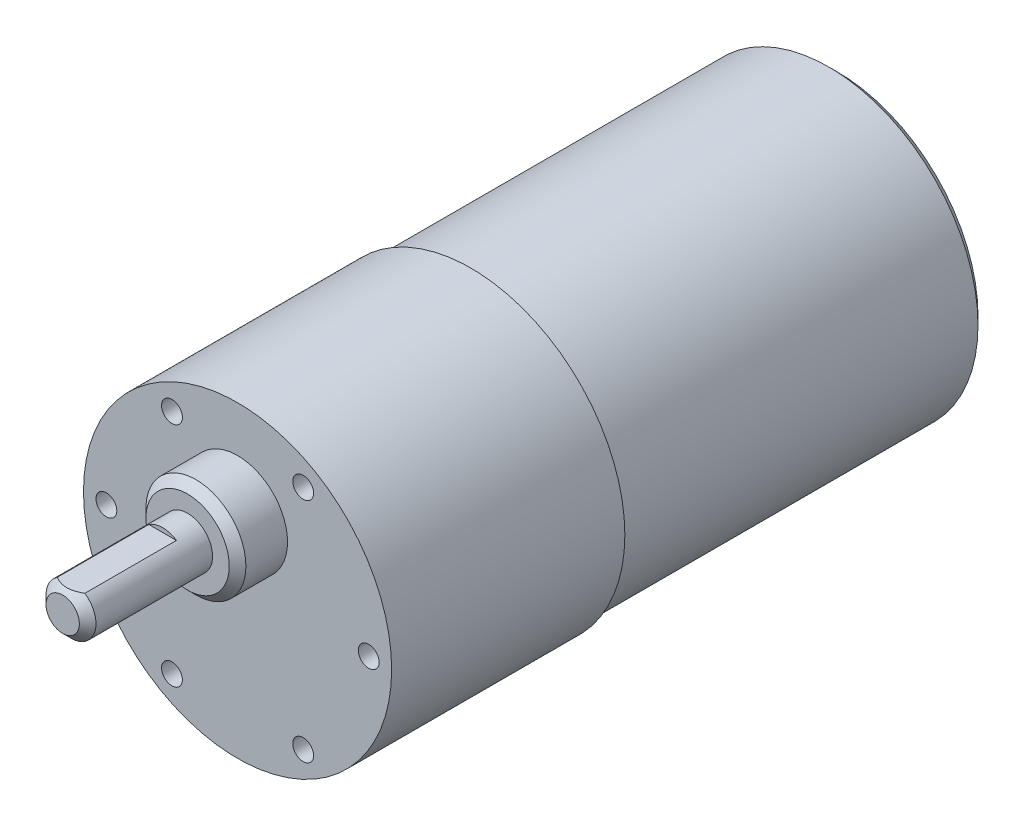
ISO-10303-21;
HEADER;
FILE_DESCRIPTION(('STEP AP214'),'2;1');
FILE_NAME('part.step','',(''),(''),'','','');
FILE_SCHEMA(('AUTOMOTIVE_DESIGN { 1 0 10303 214 1 1 1 1 }'));
ENDSEC;
DATA;
#1=APPLICATION_CONTEXT('core data for automotive mechanical design processes');
#2=APPLICATION_PROTOCOL_DEFINITION('international standard','automotive_design',2000,#1);
#3=PRODUCT_CONTEXT('',#1,'mechanical');
#4=PRODUCT('Part','Part','',(#3));
#5=PRODUCT_RELATED_PRODUCT_CATEGORY('part','',(#4));
#6=PRODUCT_DEFINITION_FORMATION('','',#4);
#7=PRODUCT_DEFINITION_CONTEXT('part definition',#1,'design');
#8=PRODUCT_DEFINITION('design','',#6,#7);
#9=PRODUCT_DEFINITION_SHAPE('','',#8);
#10=(LENGTH_UNIT() NAMED_UNIT(*) SI_UNIT(.MILLI.,.METRE.));
#11=(NAMED_UNIT(*) PLANE_ANGLE_UNIT() SI_UNIT($,.RADIAN.));
#12=(NAMED_UNIT(*) SI_UNIT($,.STERADIAN.) SOLID_ANGLE_UNIT());
#13=UNCERTAINTY_MEASURE_WITH_UNIT(LENGTH_MEASURE(1.E-05),#10,'distance_accuracy_value','');
#14=(GEOMETRIC_REPRESENTATION_CONTEXT(3) GLOBAL_UNCERTAINTY_ASSIGNED_CONTEXT((#13)) GLOBAL_UNIT_ASSIGNED_CONTEXT((#10,
#11,#12)) REPRESENTATION_CONTEXT('',''));
#15=CARTESIAN_POINT('',(0.,0.,0.));
#16=DIRECTION('',(0.,0.,1.));
#17=DIRECTION('',(1.,0.,0.));
#18=AXIS2_PLACEMENT_3D('',#15,#16,#17);
#19=CARTESIAN_POINT('',(0.,0.,44.));
#20=DIRECTION('',(0.,0.,-1.));
#21=DIRECTION('',(-1.,0.,0.));
#22=AXIS2_PLACEMENT_3D('',#19,#20,#21);
#23=CYLINDRICAL_SURFACE('',#22,17.9);
#24=CARTESIAN_POINT('',(0.,0.,1.));
#25=DIRECTION('',(0.,0.,1.));
#26=DIRECTION('',(1.,0.,0.));
#27=AXIS2_PLACEMENT_3D('',#24,#25,#26);
#28=CIRCLE('',#27,17.9);
#29=CARTESIAN_POINT('',(17.9,0.,1.));
#30=VERTEX_POINT('',#29);
#31=EDGE_CURVE('E53',#30,#30,#28,.T.);
#32=ORIENTED_EDGE('',*,*,#31,.T.);
#33=EDGE_LOOP('',(#32));
#34=FACE_BOUND('',#33,.T.);
#35=CARTESIAN_POINT('',(0.,0.,44.));
#36=DIRECTION('',(0.,0.,1.));
#37=DIRECTION('',(1.,0.,0.));
#38=AXIS2_PLACEMENT_3D('',#35,#36,#37);
#39=CIRCLE('',#38,17.9);
#40=CARTESIAN_POINT('',(17.9,0.,44.));
#41=VERTEX_POINT('',#40);
#42=EDGE_CURVE('E167',#41,#41,#39,.T.);
#43=ORIENTED_EDGE('',*,*,#42,.F.);
#44=EDGE_LOOP('',(#43));
#45=FACE_BOUND('',#44,.T.);
#46=ADVANCED_FACE('F44',(#34,#45),#23,.T.);
#47=CARTESIAN_POINT('',(0.,0.,0.));
#48=DIRECTION('',(0.,0.,1.));
#49=DIRECTION('',(1.,0.,0.));
#50=AXIS2_PLACEMENT_3D('',#47,#48,#49);
#51=PLANE('',#50);
#52=CARTESIAN_POINT('',(0.,0.,0.));
#53=DIRECTION('',(0.,0.,1.));
#54=DIRECTION('',(1.,0.,0.));
#55=AXIS2_PLACEMENT_3D('',#52,#53,#54);
#56=CIRCLE('',#55,16.9);
#57=CARTESIAN_POINT('',(16.9,0.,0.));
#58=VERTEX_POINT('',#57);
#59=EDGE_CURVE('E11',#58,#58,#56,.F.);
#60=ORIENTED_EDGE('',*,*,#59,.T.);
#61=EDGE_LOOP('',(#60));
#62=FACE_BOUND('',#61,.T.);
#63=ADVANCED_FACE('F235',(#62),#51,.F.);
#64=CARTESIAN_POINT('',(0.,0.,72.));
#65=DIRECTION('',(0.,0.,-1.));
#66=DIRECTION('',(-1.,0.,0.));
#67=AXIS2_PLACEMENT_3D('',#64,#65,#66);
#68=CYLINDRICAL_SURFACE('',#67,18.5);
#69=CARTESIAN_POINT('',(0.,0.,72.));
#70=DIRECTION('',(0.,0.,1.));
#71=DIRECTION('',(1.,0.,0.));
#72=AXIS2_PLACEMENT_3D('',#69,#70,#71);
#73=CIRCLE('',#72,18.5);
#74=CARTESIAN_POINT('',(18.5,0.,72.));
#75=VERTEX_POINT('',#74);
#76=EDGE_CURVE('E172',#75,#75,#73,.T.);
#77=ORIENTED_EDGE('',*,*,#76,.F.);
#78=EDGE_LOOP('',(#77));
#79=FACE_BOUND('',#78,.T.);
#80=CARTESIAN_POINT('',(0.,0.,44.));
#81=DIRECTION('',(0.,0.,1.));
#82=DIRECTION('',(1.,0.,0.));
#83=AXIS2_PLACEMENT_3D('',#80,#81,#82);
#84=CIRCLE('',#83,18.5);
#85=CARTESIAN_POINT('',(18.5,0.,44.));
#86=VERTEX_POINT('',#85);
#87=EDGE_CURVE('E171',#86,#86,#84,.T.);
#88=ORIENTED_EDGE('',*,*,#87,.T.);
#89=EDGE_LOOP('',(#88));
#90=FACE_BOUND('',#89,.T.);
#91=ADVANCED_FACE('F228',(#79,#90),#68,.T.);
#92=CARTESIAN_POINT('',(0.,0.,72.));
#93=DIRECTION('',(0.,0.,1.));
#94=DIRECTION('',(1.,0.,0.));
#95=AXIS2_PLACEMENT_3D('',#92,#93,#94);
#96=PLANE('',#95);
#97=CARTESIAN_POINT('',(-15.75,1.07538977722754E-13,72.));
#98=DIRECTION('',(0.,0.,1.));
#99=DIRECTION('',(1.,0.,0.));
#100=AXIS2_PLACEMENT_3D('',#97,#98,#99);
#101=CIRCLE('',#100,1.24999999999999);
#102=CARTESIAN_POINT('',(-14.5,1.07538977722754E-13,72.));
#103=VERTEX_POINT('',#102);
#104=EDGE_CURVE('E104',#103,#103,#101,.T.);
#105=ORIENTED_EDGE('',*,*,#104,.F.);
#106=EDGE_LOOP('',(#105));
#107=FACE_BOUND('',#106,.T.);
#108=CARTESIAN_POINT('',(-7.87500000000006,-13.6399001096049,72.));
#109=DIRECTION('',(0.,0.,1.));
#110=DIRECTION('',(1.,0.,0.));
#111=AXIS2_PLACEMENT_3D('',#108,#109,#110);
#112=CIRCLE('',#111,1.24999999999999);
#113=CARTESIAN_POINT('',(-6.62500000000007,-13.6399001096049,72.));
#114=VERTEX_POINT('',#113);
#115=EDGE_CURVE('E103',#114,#114,#112,.T.);
#116=ORIENTED_EDGE('',*,*,#115,.F.);
#117=EDGE_LOOP('',(#116));
#118=FACE_BOUND('',#117,.T.);
#119=CARTESIAN_POINT('',(7.87499999999997,-13.6399001096049,72.));
#120=DIRECTION('',(0.,0.,1.));
#121=DIRECTION('',(1.,0.,0.));
#122=AXIS2_PLACEMENT_3D('',#119,#120,#121);
#123=CIRCLE('',#122,1.24999999999999);
#124=CARTESIAN_POINT('',(9.12499999999996,-13.6399001096049,72.));
#125=VERTEX_POINT('',#124);
#126=EDGE_CURVE('E117',#125,#125,#123,.T.);
#127=ORIENTED_EDGE('',*,*,#126,.F.);
#128=EDGE_LOOP('',(#127));
#129=FACE_BOUND('',#128,.T.);
#130=CARTESIAN_POINT('',(15.75,0.,72.));
#131=DIRECTION('',(0.,0.,1.));
#132=DIRECTION('',(1.,0.,0.));
#133=AXIS2_PLACEMENT_3D('',#130,#131,#132);
#134=CIRCLE('',#133,1.24999999999999);
#135=CARTESIAN_POINT('',(17.,0.,72.));
#136=VERTEX_POINT('',#135);
#137=EDGE_CURVE('E125',#136,#136,#134,.T.);
#138=ORIENTED_EDGE('',*,*,#137,.F.);
#139=EDGE_LOOP('',(#138));
#140=FACE_BOUND('',#139,.T.);
#141=CARTESIAN_POINT('',(7.87500000000002,13.6399001096049,72.));
#142=DIRECTION('',(0.,0.,1.));
#143=DIRECTION('',(1.,0.,0.));
#144=AXIS2_PLACEMENT_3D('',#141,#142,#143);
#145=CIRCLE('',#144,1.24999999999999);
#146=CARTESIAN_POINT('',(9.12500000000001,13.6399001096049,72.));
#147=VERTEX_POINT('',#146);
#148=EDGE_CURVE('E133',#147,#147,#145,.T.);
#149=ORIENTED_EDGE('',*,*,#148,.F.);
#150=EDGE_LOOP('',(#149));
#151=FACE_BOUND('',#150,.T.);
#152=CARTESIAN_POINT('',(-7.87499999999987,13.639900109605,72.));
#153=DIRECTION('',(0.,0.,1.));
#154=DIRECTION('',(1.,0.,0.));
#155=AXIS2_PLACEMENT_3D('',#152,#153,#154);
#156=CIRCLE('',#155,1.24999999999999);
#157=CARTESIAN_POINT('',(-6.62499999999989,13.639900109605,72.));
#158=VERTEX_POINT('',#157);
#159=EDGE_CURVE('E141',#158,#158,#156,.T.);
#160=ORIENTED_EDGE('',*,*,#159,.F.);
#161=EDGE_LOOP('',(#160));
#162=FACE_BOUND('',#161,.T.);
#163=CARTESIAN_POINT('',(0.,7.,72.));
#164=DIRECTION('',(0.,0.,1.));
#165=DIRECTION('',(1.,0.,0.));
#166=AXIS2_PLACEMENT_3D('',#163,#164,#165);
#167=CIRCLE('',#166,6.);
#168=CARTESIAN_POINT('',(6.,7.,72.));
#169=VERTEX_POINT('',#168);
#170=EDGE_CURVE('E160',#169,#169,#167,.T.);
#171=ORIENTED_EDGE('',*,*,#170,.F.);
#172=EDGE_LOOP('',(#171));
#173=FACE_BOUND('',#172,.T.);
#174=ORIENTED_EDGE('',*,*,#76,.T.);
#175=EDGE_LOOP('',(#174));
#176=FACE_BOUND('',#175,.T.);
#177=ADVANCED_FACE('F225',(#107,#118,#129,#140,#151,#162,#173,#176),#96,.T.);
#178=CARTESIAN_POINT('',(0.,0.,44.));
#179=DIRECTION('',(0.,0.,1.));
#180=DIRECTION('',(1.,0.,0.));
#181=AXIS2_PLACEMENT_3D('',#178,#179,#180);
#182=PLANE('',#181);
#183=ORIENTED_EDGE('',*,*,#42,.T.);
#184=EDGE_LOOP('',(#183));
#185=FACE_BOUND('',#184,.T.);
#186=ORIENTED_EDGE('',*,*,#87,.F.);
#187=EDGE_LOOP('',(#186));
#188=FACE_BOUND('',#187,.T.);
#189=ADVANCED_FACE('F223',(#185,#188),#182,.F.);
#190=CARTESIAN_POINT('',(0.,7.,78.));
#191=DIRECTION('',(0.,0.,-1.));
#192=DIRECTION('',(-1.,0.,0.));
#193=AXIS2_PLACEMENT_3D('',#190,#191,#192);
#194=CYLINDRICAL_SURFACE('',#193,6.);
#195=CARTESIAN_POINT('',(0.,7.,77.));
#196=DIRECTION('',(0.,0.,1.));
#197=DIRECTION('',(1.,0.,0.));
#198=AXIS2_PLACEMENT_3D('',#195,#196,#197);
#199=CIRCLE('',#198,6.);
#200=CARTESIAN_POINT('',(6.,7.,77.));
#201=VERTEX_POINT('',#200);
#202=EDGE_CURVE('E253',#201,#201,#199,.F.);
#203=ORIENTED_EDGE('',*,*,#202,.T.);
#204=EDGE_LOOP('',(#203));
#205=FACE_BOUND('',#204,.T.);
#206=ORIENTED_EDGE('',*,*,#170,.T.);
#207=EDGE_LOOP('',(#206));
#208=FACE_BOUND('',#207,.T.);
#209=ADVANCED_FACE('F219',(#205,#208),#194,.T.);
#210=CARTESIAN_POINT('',(0.,0.,78.));
#211=DIRECTION('',(0.,0.,1.));
#212=DIRECTION('',(1.,0.,0.));
#213=AXIS2_PLACEMENT_3D('',#210,#211,#212);
#214=PLANE('',#213);
#215=CARTESIAN_POINT('',(0.,7.,78.));
#216=DIRECTION('',(0.,0.,1.));
#217=DIRECTION('',(1.,0.,0.));
#218=AXIS2_PLACEMENT_3D('',#215,#216,#217);
#219=CIRCLE('',#218,4.99999999999999);
#220=CARTESIAN_POINT('',(4.99999999999999,7.,78.));
#221=VERTEX_POINT('',#220);
#222=EDGE_CURVE('E196',#221,#221,#219,.T.);
#223=ORIENTED_EDGE('',*,*,#222,.T.);
#224=EDGE_LOOP('',(#223));
#225=FACE_BOUND('',#224,.T.);
#226=CARTESIAN_POINT('',(0.,7.,78.));
#227=DIRECTION('',(0.,0.,1.));
#228=DIRECTION('',(1.,0.,0.));
#229=AXIS2_PLACEMENT_3D('',#226,#227,#228);
#230=CIRCLE('',#229,3.);
#231=CARTESIAN_POINT('',(3.,7.,78.));
#232=VERTEX_POINT('',#231);
#233=EDGE_CURVE('E163',#232,#232,#230,.T.);
#234=ORIENTED_EDGE('',*,*,#233,.F.);
#235=EDGE_LOOP('',(#234));
#236=FACE_BOUND('',#235,.T.);
#237=ADVANCED_FACE('F215',(#225,#236),#214,.T.);
#238=CARTESIAN_POINT('',(0.,7.,93.));
#239=DIRECTION('',(0.,0.,-1.));
#240=DIRECTION('',(-1.,0.,0.));
#241=AXIS2_PLACEMENT_3D('',#238,#239,#240);
#242=CYLINDRICAL_SURFACE('',#241,3.);
#243=DIRECTION('',(0.,0.,1.));
#244=VECTOR('',#243,1.);
#245=CARTESIAN_POINT('',(1.6583123951777,9.5,81.));
#246=LINE('',#245,#244);
#247=CARTESIAN_POINT('',(1.6583123951777,9.5,81.));
#248=VERTEX_POINT('',#247);
#249=CARTESIAN_POINT('',(1.6583123951777,9.5,92.));
#250=VERTEX_POINT('',#249);
#251=EDGE_CURVE('E157',#248,#250,#246,.T.);
#252=ORIENTED_EDGE('',*,*,#251,.T.);
#253=CARTESIAN_POINT('',(0.,7.,92.));
#254=DIRECTION('',(0.,0.,1.));
#255=DIRECTION('',(1.,0.,0.));
#256=AXIS2_PLACEMENT_3D('',#253,#254,#255);
#257=CIRCLE('',#256,3.);
#258=CARTESIAN_POINT('',(-1.6583123951777,9.5,92.));
#259=VERTEX_POINT('',#258);
#260=EDGE_CURVE('E184',#250,#259,#257,.F.);
#261=ORIENTED_EDGE('',*,*,#260,.T.);
#262=DIRECTION('',(0.,0.,1.));
#263=VECTOR('',#262,1.);
#264=CARTESIAN_POINT('',(-1.6583123951777,9.5,81.));
#265=LINE('',#264,#263);
#266=CARTESIAN_POINT('',(-1.6583123951777,9.5,81.));
#267=VERTEX_POINT('',#266);
#268=EDGE_CURVE('E156',#267,#259,#265,.T.);
#269=ORIENTED_EDGE('',*,*,#268,.F.);
#270=CARTESIAN_POINT('',(0.,7.,81.));
#271=DIRECTION('',(0.,0.,1.));
#272=DIRECTION('',(1.,0.,0.));
#273=AXIS2_PLACEMENT_3D('',#270,#271,#272);
#274=CIRCLE('',#273,3.);
#275=EDGE_CURVE('E149',#248,#267,#274,.T.);
#276=ORIENTED_EDGE('',*,*,#275,.F.);
#277=EDGE_LOOP('',(#252,#261,#269,#276));
#278=FACE_BOUND('',#277,.T.);
#279=ORIENTED_EDGE('',*,*,#233,.T.);
#280=EDGE_LOOP('',(#279));
#281=FACE_BOUND('',#280,.T.);
#282=ADVANCED_FACE('F211',(#278,#281),#242,.T.);
#283=CARTESIAN_POINT('',(0.,7.,93.));
#284=DIRECTION('',(0.,0.,1.));
#285=DIRECTION('',(1.,0.,0.));
#286=AXIS2_PLACEMENT_3D('',#283,#284,#285);
#287=PLANE('',#286);
#288=CARTESIAN_POINT('',(0.,7.,93.));
#289=DIRECTION('',(0.,0.,1.));
#290=DIRECTION('',(1.,0.,0.));
#291=AXIS2_PLACEMENT_3D('',#288,#289,#290);
#292=CIRCLE('',#291,2.00000000000001);
#293=CARTESIAN_POINT('',(-1.10554159678514,8.66666666666668,93.));
#294=VERTEX_POINT('',#293);
#295=EDGE_CURVE('E58',#294,#294,#292,.T.);
#296=ORIENTED_EDGE('',*,*,#295,.T.);
#297=EDGE_LOOP('',(#296));
#298=FACE_BOUND('',#297,.T.);
#299=ADVANCED_FACE('F207',(#298),#287,.T.);
#300=CARTESIAN_POINT('',(0.,9.5,81.));
#301=DIRECTION('',(0.,-1.,0.));
#302=DIRECTION('',(0.,0.,-1.));
#303=AXIS2_PLACEMENT_3D('',#300,#301,#302);
#304=PLANE('',#303);
#305=ORIENTED_EDGE('',*,*,#268,.T.);
#306=CARTESIAN_POINT('',(-1.6583123951777,9.5,92.));
#307=CARTESIAN_POINT('',(-1.56942715076811,9.5,92.0490826893848));
#308=CARTESIAN_POINT('',(-1.47934409449581,9.5,92.0961830511337));
#309=CARTESIAN_POINT('',(-1.29617847321724,9.5,92.1851173780035));
#310=CARTESIAN_POINT('',(-1.20308522397406,9.5,92.2269292072721));
#311=CARTESIAN_POINT('',(-1.01307221495188,9.5,92.3039434837195));
#312=CARTESIAN_POINT('',(-0.916123604225691,9.5,92.3390760520738));
#313=CARTESIAN_POINT('',(-0.719482950503408,9.5,92.4002007354829));
#314=CARTESIAN_POINT('',(-0.619795484750031,9.5,92.4262072065172));
#315=CARTESIAN_POINT('',(-0.445308268358779,9.5,92.4616754950384));
#316=CARTESIAN_POINT('',(-0.371030933281325,9.5,92.4737063004716));
#317=CARTESIAN_POINT('',(-0.221695353210787,9.5,92.4912838235938));
#318=CARTESIAN_POINT('',(-0.146637092963818,9.5,92.4968304143851));
#319=CARTESIAN_POINT('',(0.00301542104204263,9.5,92.5011073370395));
#320=CARTESIAN_POINT('',(0.0776079547635823,9.5,92.4998971501255));
#321=CARTESIAN_POINT('',(0.226390638774234,9.5,92.4908698603031));
#322=CARTESIAN_POINT('',(0.300580744866636,9.5,92.4830520459262));
#323=CARTESIAN_POINT('',(0.466035145528541,9.5,92.4585504205052));
#324=CARTESIAN_POINT('',(0.557047968491458,9.5,92.4401685915443));
#325=CARTESIAN_POINT('',(0.73700109460886,9.5,92.3950891156308));
#326=CARTESIAN_POINT('',(0.825940041979194,9.5,92.3683861840428));
#327=CARTESIAN_POINT('',(1.0030210912686,9.5,92.3076025120423));
#328=CARTESIAN_POINT('',(1.09111992042933,9.5,92.2733974411135));
#329=CARTESIAN_POINT('',(1.26485128696635,9.5,92.1993428104102));
#330=CARTESIAN_POINT('',(1.35048445150933,9.5,92.1594947015372));
#331=CARTESIAN_POINT('',(1.57953049780928,9.5,92.0454877815754));
#332=CARTESIAN_POINT('',(1.72080515389092,9.5,91.9670537608018));
#333=CARTESIAN_POINT('',(1.99820187651894,9.5,91.8014926895908));
#334=CARTESIAN_POINT('',(2.13431939237604,9.5,91.7143581974068));
#335=CARTESIAN_POINT('',(2.40308740212732,9.5,91.5337487074533));
#336=CARTESIAN_POINT('',(2.53572077485568,9.5,91.4402484240217));
#337=CARTESIAN_POINT('',(2.79781667246586,9.5,91.2490319334926));
#338=CARTESIAN_POINT('',(2.92728029519625,9.5,91.1513172194029));
#339=CARTESIAN_POINT('',(3.17155923373129,9.5,90.9622526164554));
#340=CARTESIAN_POINT('',(3.28659382446427,9.5,90.8711847237559));
#341=CARTESIAN_POINT('',(3.51509075394976,9.5,90.6870788966271));
#342=CARTESIAN_POINT('',(3.62855293445602,9.5,90.5940407662624));
#343=CARTESIAN_POINT('',(3.85313787714926,9.5,90.4073094886393));
#344=CARTESIAN_POINT('',(3.96427260193688,9.5,90.3136306914605));
#345=CARTESIAN_POINT('',(4.18547886605326,9.5,90.1250697652643));
#346=CARTESIAN_POINT('',(4.29555061412446,9.5,90.0301878813312));
#347=CARTESIAN_POINT('',(4.40520964177998,9.5,89.9348374174138));
#348=B_SPLINE_CURVE_WITH_KNOTS('',3,(#306,#307,#308,#309,#310,#311,#312,#313,#314,#315,#316,
#317,#318,#319,#320,#321,#322,#323,#324,#325,#326,#327,#328,#329,#330,#331,#332,#333,#334,#335,
#336,#337,#338,#339,#340,#341,#342,#343,#344,#345,#346,#347),.UNSPECIFIED.,.F.,.F.,(4,2,2,2,2,2,
2,2,2,2,2,2,2,2,2,2,2,2,2,2,4),(0.,0.30472088015965,0.610677734814859,0.919677873269157,
1.22818973099608,1.45367192334252,1.67915852835391,1.90266327863509,2.12619209759739,
2.40426885814667,2.68252258317565,2.96579275597332,3.24899022795962,3.73323192771598,
4.2178914192597,4.70460313212478,5.19114381600281,5.63127314547572,6.07144645220793,
6.50748724557874,6.94344059505213),.UNSPECIFIED.);
#349=EDGE_CURVE('E65',#259,#250,#348,.T.);
#350=ORIENTED_EDGE('',*,*,#349,.T.);
#351=ORIENTED_EDGE('',*,*,#251,.F.);
#352=DIRECTION('',(1.,0.,0.));
#353=VECTOR('',#352,1.);
#354=CARTESIAN_POINT('',(0.,9.5,81.));
#355=LINE('',#354,#353);
#356=EDGE_CURVE('E152',#267,#248,#355,.T.);
#357=ORIENTED_EDGE('',*,*,#356,.F.);
#358=EDGE_LOOP('',(#305,#350,#351,#357));
#359=FACE_BOUND('',#358,.T.);
#360=ADVANCED_FACE('F201',(#359),#304,.F.);
#361=CARTESIAN_POINT('',(0.,0.,81.));
#362=DIRECTION('',(0.,0.,1.));
#363=DIRECTION('',(1.,0.,0.));
#364=AXIS2_PLACEMENT_3D('',#361,#362,#363);
#365=PLANE('',#364);
#366=ORIENTED_EDGE('',*,*,#275,.T.);
#367=ORIENTED_EDGE('',*,*,#356,.T.);
#368=EDGE_LOOP('',(#366,#367));
#369=FACE_BOUND('',#368,.T.);
#370=ADVANCED_FACE('F206',(#369),#365,.T.);
#371=CARTESIAN_POINT('',(-7.87499999999987,13.639900109605,63.5));
#372=DIRECTION('',(0.,0.,1.));
#373=DIRECTION('',(1.,0.,0.));
#374=AXIS2_PLACEMENT_3D('',#371,#372,#373);
#375=CONICAL_SURFACE('',#374,1.24999999999999,1.02974425867665);
#376=CARTESIAN_POINT('',(-7.87499999999988,13.639900109605,62.7489242262155));
#377=VERTEX_POINT('',#376);
#378=VERTEX_LOOP('',#377);
#379=FACE_BOUND('',#378,.T.);
#380=CARTESIAN_POINT('',(-7.87499999999987,13.639900109605,63.5));
#381=DIRECTION('',(0.,0.,1.));
#382=DIRECTION('',(1.,0.,0.));
#383=AXIS2_PLACEMENT_3D('',#380,#381,#382);
#384=CIRCLE('',#383,1.24999999999999);
#385=CARTESIAN_POINT('',(-6.62499999999989,13.639900109605,63.5));
#386=VERTEX_POINT('',#385);
#387=EDGE_CURVE('E145',#386,#386,#384,.T.);
#388=ORIENTED_EDGE('',*,*,#387,.T.);
#389=EDGE_LOOP('',(#388));
#390=FACE_BOUND('',#389,.T.);
#391=ADVANCED_FACE('F281',(#379,#390),#375,.F.);
#392=CARTESIAN_POINT('',(-7.87499999999987,13.639900109605,72.));
#393=DIRECTION('',(0.,0.,1.));
#394=DIRECTION('',(1.,0.,0.));
#395=AXIS2_PLACEMENT_3D('',#392,#393,#394);
#396=CYLINDRICAL_SURFACE('',#395,1.24999999999999);
#397=ORIENTED_EDGE('',*,*,#387,.F.);
#398=EDGE_LOOP('',(#397));
#399=FACE_BOUND('',#398,.T.);
#400=ORIENTED_EDGE('',*,*,#159,.T.);
#401=EDGE_LOOP('',(#400));
#402=FACE_BOUND('',#401,.T.);
#403=ADVANCED_FACE('F286',(#399,#402),#396,.F.);
#404=CARTESIAN_POINT('',(7.87500000000002,13.6399001096049,63.5));
#405=DIRECTION('',(0.,0.,1.));
#406=DIRECTION('',(1.,0.,0.));
#407=AXIS2_PLACEMENT_3D('',#404,#405,#406);
#408=CONICAL_SURFACE('',#407,1.24999999999999,1.02974425867665);
#409=CARTESIAN_POINT('',(7.87500000000001,13.6399001096049,62.7489242262155));
#410=VERTEX_POINT('',#409);
#411=VERTEX_LOOP('',#410);
#412=FACE_BOUND('',#411,.T.);
#413=CARTESIAN_POINT('',(7.87500000000002,13.6399001096049,63.5));
#414=DIRECTION('',(0.,0.,1.));
#415=DIRECTION('',(1.,0.,0.));
#416=AXIS2_PLACEMENT_3D('',#413,#414,#415);
#417=CIRCLE('',#416,1.24999999999999);
#418=CARTESIAN_POINT('',(9.125,13.6399001096049,63.5));
#419=VERTEX_POINT('',#418);
#420=EDGE_CURVE('E137',#419,#419,#417,.T.);
#421=ORIENTED_EDGE('',*,*,#420,.T.);
#422=EDGE_LOOP('',(#421));
#423=FACE_BOUND('',#422,.T.);
#424=ADVANCED_FACE('F291',(#412,#423),#408,.F.);
#425=CARTESIAN_POINT('',(7.87500000000002,13.6399001096049,72.));
#426=DIRECTION('',(0.,0.,1.));
#427=DIRECTION('',(1.,0.,0.));
#428=AXIS2_PLACEMENT_3D('',#425,#426,#427);
#429=CYLINDRICAL_SURFACE('',#428,1.24999999999999);
#430=ORIENTED_EDGE('',*,*,#420,.F.);
#431=EDGE_LOOP('',(#430));
#432=FACE_BOUND('',#431,.T.);
#433=ORIENTED_EDGE('',*,*,#148,.T.);
#434=EDGE_LOOP('',(#433));
#435=FACE_BOUND('',#434,.T.);
#436=ADVANCED_FACE('F298',(#432,#435),#429,.F.);
#437=CARTESIAN_POINT('',(15.75,0.,63.5));
#438=DIRECTION('',(0.,0.,1.));
#439=DIRECTION('',(1.,0.,0.));
#440=AXIS2_PLACEMENT_3D('',#437,#438,#439);
#441=CONICAL_SURFACE('',#440,1.24999999999999,1.02974425867665);
#442=CARTESIAN_POINT('',(15.75,0.,62.7489242262155));
#443=VERTEX_POINT('',#442);
#444=VERTEX_LOOP('',#443);
#445=FACE_BOUND('',#444,.T.);
#446=CARTESIAN_POINT('',(15.75,0.,63.5));
#447=DIRECTION('',(0.,0.,1.));
#448=DIRECTION('',(1.,0.,0.));
#449=AXIS2_PLACEMENT_3D('',#446,#447,#448);
#450=CIRCLE('',#449,1.24999999999999);
#451=CARTESIAN_POINT('',(17.,0.,63.5));
#452=VERTEX_POINT('',#451);
#453=EDGE_CURVE('E129',#452,#452,#450,.T.);
#454=ORIENTED_EDGE('',*,*,#453,.T.);
#455=EDGE_LOOP('',(#454));
#456=FACE_BOUND('',#455,.T.);
#457=ADVANCED_FACE('F302',(#445,#456),#441,.F.);
#458=CARTESIAN_POINT('',(15.75,0.,72.));
#459=DIRECTION('',(0.,0.,1.));
#460=DIRECTION('',(1.,0.,0.));
#461=AXIS2_PLACEMENT_3D('',#458,#459,#460);
#462=CYLINDRICAL_SURFACE('',#461,1.24999999999999);
#463=ORIENTED_EDGE('',*,*,#453,.F.);
#464=EDGE_LOOP('',(#463));
#465=FACE_BOUND('',#464,.T.);
#466=ORIENTED_EDGE('',*,*,#137,.T.);
#467=EDGE_LOOP('',(#466));
#468=FACE_BOUND('',#467,.T.);
#469=ADVANCED_FACE('F306',(#465,#468),#462,.F.);
#470=CARTESIAN_POINT('',(7.87499999999997,-13.6399001096049,63.5));
#471=DIRECTION('',(0.,0.,1.));
#472=DIRECTION('',(1.,0.,0.));
#473=AXIS2_PLACEMENT_3D('',#470,#471,#472);
#474=CONICAL_SURFACE('',#473,1.24999999999999,1.02974425867665);
#475=CARTESIAN_POINT('',(7.87499999999997,-13.6399001096049,62.7489242262155));
#476=VERTEX_POINT('',#475);
#477=VERTEX_LOOP('',#476);
#478=FACE_BOUND('',#477,.T.);
#479=CARTESIAN_POINT('',(7.87499999999997,-13.6399001096049,63.5));
#480=DIRECTION('',(0.,0.,1.));
#481=DIRECTION('',(1.,0.,0.));
#482=AXIS2_PLACEMENT_3D('',#479,#480,#481);
#483=CIRCLE('',#482,1.24999999999999);
#484=CARTESIAN_POINT('',(9.12499999999996,-13.6399001096049,63.5));
#485=VERTEX_POINT('',#484);
#486=EDGE_CURVE('E121',#485,#485,#483,.T.);
#487=ORIENTED_EDGE('',*,*,#486,.T.);
#488=EDGE_LOOP('',(#487));
#489=FACE_BOUND('',#488,.T.);
#490=ADVANCED_FACE('F310',(#478,#489),#474,.F.);
#491=CARTESIAN_POINT('',(7.87499999999997,-13.6399001096049,72.));
#492=DIRECTION('',(0.,0.,1.));
#493=DIRECTION('',(1.,0.,0.));
#494=AXIS2_PLACEMENT_3D('',#491,#492,#493);
#495=CYLINDRICAL_SURFACE('',#494,1.24999999999999);
#496=ORIENTED_EDGE('',*,*,#486,.F.);
#497=EDGE_LOOP('',(#496));
#498=FACE_BOUND('',#497,.T.);
#499=ORIENTED_EDGE('',*,*,#126,.T.);
#500=EDGE_LOOP('',(#499));
#501=FACE_BOUND('',#500,.T.);
#502=ADVANCED_FACE('F314',(#498,#501),#495,.F.);
#503=CARTESIAN_POINT('',(-7.87500000000006,-13.6399001096049,63.5));
#504=DIRECTION('',(0.,0.,1.));
#505=DIRECTION('',(1.,0.,0.));
#506=AXIS2_PLACEMENT_3D('',#503,#504,#505);
#507=CONICAL_SURFACE('',#506,1.24999999999999,1.02974425867665);
#508=CARTESIAN_POINT('',(-7.87500000000006,-13.6399001096049,62.7489242262155));
#509=VERTEX_POINT('',#508);
#510=VERTEX_LOOP('',#509);
#511=FACE_BOUND('',#510,.T.);
#512=CARTESIAN_POINT('',(-7.87500000000006,-13.6399001096049,63.5));
#513=DIRECTION('',(0.,0.,1.));
#514=DIRECTION('',(1.,0.,0.));
#515=AXIS2_PLACEMENT_3D('',#512,#513,#514);
#516=CIRCLE('',#515,1.24999999999999);
#517=CARTESIAN_POINT('',(-6.62500000000007,-13.6399001096049,63.5));
#518=VERTEX_POINT('',#517);
#519=EDGE_CURVE('E109',#518,#518,#516,.T.);
#520=ORIENTED_EDGE('',*,*,#519,.T.);
#521=EDGE_LOOP('',(#520));
#522=FACE_BOUND('',#521,.T.);
#523=ADVANCED_FACE('F318',(#511,#522),#507,.F.);
#524=CARTESIAN_POINT('',(-7.87500000000006,-13.6399001096049,72.));
#525=DIRECTION('',(0.,0.,1.));
#526=DIRECTION('',(1.,0.,0.));
#527=AXIS2_PLACEMENT_3D('',#524,#525,#526);
#528=CYLINDRICAL_SURFACE('',#527,1.24999999999999);
#529=ORIENTED_EDGE('',*,*,#519,.F.);
#530=EDGE_LOOP('',(#529));
#531=FACE_BOUND('',#530,.T.);
#532=ORIENTED_EDGE('',*,*,#115,.T.);
#533=EDGE_LOOP('',(#532));
#534=FACE_BOUND('',#533,.T.);
#535=ADVANCED_FACE('F96',(#531,#534),#528,.F.);
#536=CARTESIAN_POINT('',(-15.75,1.07538977722754E-13,63.5));
#537=DIRECTION('',(0.,0.,1.));
#538=DIRECTION('',(1.,0.,0.));
#539=AXIS2_PLACEMENT_3D('',#536,#537,#538);
#540=CONICAL_SURFACE('',#539,1.24999999999999,1.02974425867665);
#541=CARTESIAN_POINT('',(-15.75,1.07538977722754E-13,62.7489242262155));
#542=VERTEX_POINT('',#541);
#543=VERTEX_LOOP('',#542);
#544=FACE_BOUND('',#543,.T.);
#545=CARTESIAN_POINT('',(-15.75,1.07538977722754E-13,63.5));
#546=DIRECTION('',(0.,0.,1.));
#547=DIRECTION('',(1.,0.,0.));
#548=AXIS2_PLACEMENT_3D('',#545,#546,#547);
#549=CIRCLE('',#548,1.24999999999999);
#550=CARTESIAN_POINT('',(-14.5,1.07538977722754E-13,63.5));
#551=VERTEX_POINT('',#550);
#552=EDGE_CURVE('E100',#551,#551,#549,.T.);
#553=ORIENTED_EDGE('',*,*,#552,.T.);
#554=EDGE_LOOP('',(#553));
#555=FACE_BOUND('',#554,.T.);
#556=ADVANCED_FACE('F92',(#544,#555),#540,.F.);
#557=CARTESIAN_POINT('',(-15.75,1.07538977722754E-13,72.));
#558=DIRECTION('',(0.,0.,1.));
#559=DIRECTION('',(1.,0.,0.));
#560=AXIS2_PLACEMENT_3D('',#557,#558,#559);
#561=CYLINDRICAL_SURFACE('',#560,1.24999999999999);
#562=ORIENTED_EDGE('',*,*,#552,.F.);
#563=EDGE_LOOP('',(#562));
#564=FACE_BOUND('',#563,.T.);
#565=ORIENTED_EDGE('',*,*,#104,.T.);
#566=EDGE_LOOP('',(#565));
#567=FACE_BOUND('',#566,.T.);
#568=ADVANCED_FACE('F95',(#564,#567),#561,.F.);
#569=CARTESIAN_POINT('',(0.,7.,93.));
#570=DIRECTION('',(0.,0.,-1.));
#571=DIRECTION('',(-1.,0.,0.));
#572=AXIS2_PLACEMENT_3D('',#569,#570,#571);
#573=CONICAL_SURFACE('',#572,2.00000000000001,0.785398163397449);
#574=ORIENTED_EDGE('',*,*,#349,.F.);
#575=ORIENTED_EDGE('',*,*,#260,.F.);
#576=EDGE_LOOP('',(#574,#575));
#577=FACE_BOUND('',#576,.T.);
#578=ORIENTED_EDGE('',*,*,#295,.F.);
#579=EDGE_LOOP('',(#578));
#580=FACE_BOUND('',#579,.T.);
#581=ADVANCED_FACE('F198',(#577,#580),#573,.T.);
#582=CARTESIAN_POINT('',(0.,7.,78.));
#583=DIRECTION('',(0.,0.,-1.));
#584=DIRECTION('',(-1.,0.,0.));
#585=AXIS2_PLACEMENT_3D('',#582,#583,#584);
#586=CONICAL_SURFACE('',#585,4.99999999999999,0.785398163397453);
#587=ORIENTED_EDGE('',*,*,#202,.F.);
#588=EDGE_LOOP('',(#587));
#589=FACE_BOUND('',#588,.T.);
#590=ORIENTED_EDGE('',*,*,#222,.F.);
#591=EDGE_LOOP('',(#590));
#592=FACE_BOUND('',#591,.T.);
#593=ADVANCED_FACE('F262',(#589,#592),#586,.T.);
#594=CARTESIAN_POINT('',(0.,0.,1.));
#595=DIRECTION('',(0.,0.,1.));
#596=DIRECTION('',(1.,0.,0.));
#597=AXIS2_PLACEMENT_3D('',#594,#595,#596);
#598=CONICAL_SURFACE('',#597,17.9,0.785398163397455);
#599=ORIENTED_EDGE('',*,*,#59,.F.);
#600=EDGE_LOOP('',(#599));
#601=FACE_BOUND('',#600,.T.);
#602=ORIENTED_EDGE('',*,*,#31,.F.);
#603=EDGE_LOOP('',(#602));
#604=FACE_BOUND('',#603,.T.);
#605=ADVANCED_FACE('F46',(#601,#604),#598,.T.);
#606=CLOSED_SHELL('',(#46,#63,#91,#177,#189,#209,#237,#282,#299,#360,#370,#391,#403,#424,#436,
#457,#469,#490,#502,#523,#535,#556,#568,#581,#593,#605));
#607=MANIFOLD_SOLID_BREP('B2',#606);
#608=ADVANCED_BREP_SHAPE_REPRESENTATION('',(#18,#607),#14);
#609=SHAPE_DEFINITION_REPRESENTATION(#9,#608);
ENDSEC;
END-ISO-10303-21;
